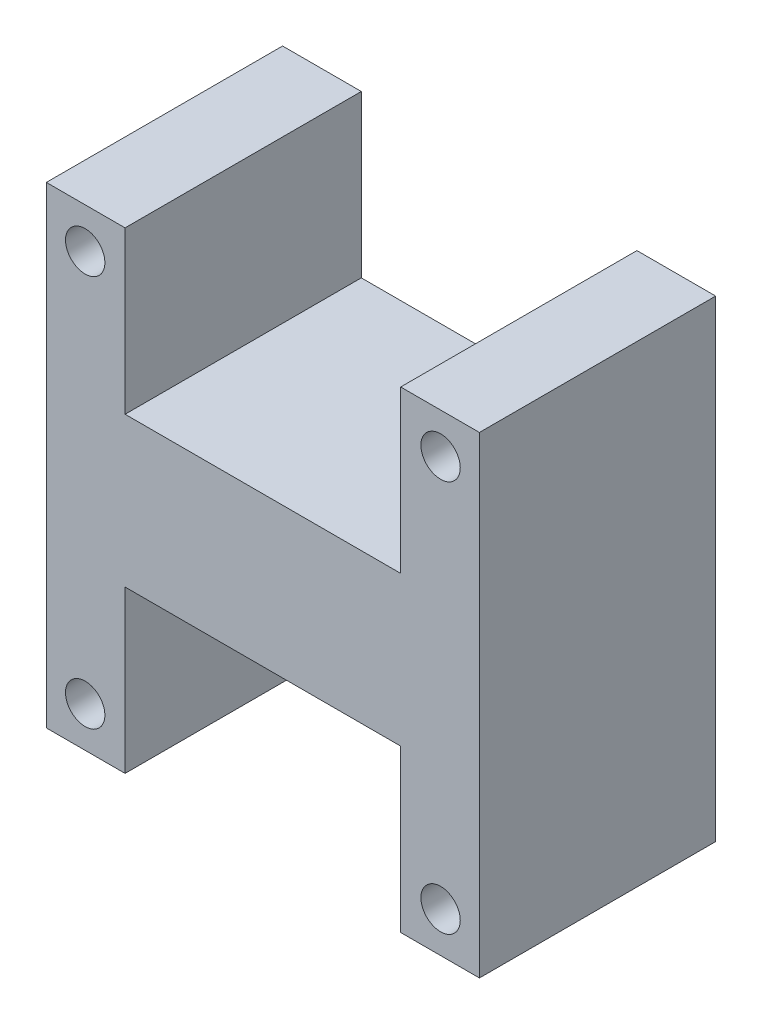
ISO-10303-21;
HEADER;
FILE_DESCRIPTION(('STEP AP214'),'2;1');
FILE_NAME('part.step','',(''),(''),'','','');
FILE_SCHEMA(('AUTOMOTIVE_DESIGN { 1 0 10303 214 1 1 1 1 }'));
ENDSEC;
DATA;
#1=APPLICATION_CONTEXT('core data for automotive mechanical design processes');
#2=APPLICATION_PROTOCOL_DEFINITION('international standard','automotive_design',2000,#1);
#3=PRODUCT_CONTEXT('',#1,'mechanical');
#4=PRODUCT('Part','Part','',(#3));
#5=PRODUCT_RELATED_PRODUCT_CATEGORY('part','',(#4));
#6=PRODUCT_DEFINITION_FORMATION('','',#4);
#7=PRODUCT_DEFINITION_CONTEXT('part definition',#1,'design');
#8=PRODUCT_DEFINITION('design','',#6,#7);
#9=PRODUCT_DEFINITION_SHAPE('','',#8);
#10=(LENGTH_UNIT() NAMED_UNIT(*) SI_UNIT(.MILLI.,.METRE.));
#11=(NAMED_UNIT(*) PLANE_ANGLE_UNIT() SI_UNIT($,.RADIAN.));
#12=(NAMED_UNIT(*) SI_UNIT($,.STERADIAN.) SOLID_ANGLE_UNIT());
#13=UNCERTAINTY_MEASURE_WITH_UNIT(LENGTH_MEASURE(1.E-05),#10,'distance_accuracy_value','');
#14=(GEOMETRIC_REPRESENTATION_CONTEXT(3) GLOBAL_UNCERTAINTY_ASSIGNED_CONTEXT((#13)) GLOBAL_UNIT_ASSIGNED_CONTEXT((#10,
#11,#12)) REPRESENTATION_CONTEXT('',''));
#15=CARTESIAN_POINT('',(0.,0.,0.));
#16=DIRECTION('',(0.,0.,1.));
#17=DIRECTION('',(1.,0.,0.));
#18=AXIS2_PLACEMENT_3D('',#15,#16,#17);
#19=CARTESIAN_POINT('',(57.15,0.,38.1));
#20=DIRECTION('',(-1.,0.,0.));
#21=DIRECTION('',(0.,0.,1.));
#22=AXIS2_PLACEMENT_3D('',#19,#20,#21);
#23=PLANE('',#22);
#24=DIRECTION('',(0.,1.,0.));
#25=VECTOR('',#24,1.);
#26=CARTESIAN_POINT('',(57.15,0.,0.));
#27=LINE('',#26,#25);
#28=CARTESIAN_POINT('',(57.15,0.,0.));
#29=VERTEX_POINT('',#28);
#30=CARTESIAN_POINT('',(57.15,26.035,0.));
#31=VERTEX_POINT('',#30);
#32=EDGE_CURVE('E194',#29,#31,#27,.T.);
#33=ORIENTED_EDGE('',*,*,#32,.F.);
#34=DIRECTION('',(0.,0.,-1.));
#35=VECTOR('',#34,1.);
#36=CARTESIAN_POINT('',(57.15,0.,38.1));
#37=LINE('',#36,#35);
#38=CARTESIAN_POINT('',(57.15,0.,38.1));
#39=VERTEX_POINT('',#38);
#40=EDGE_CURVE('E13',#39,#29,#37,.T.);
#41=ORIENTED_EDGE('',*,*,#40,.F.);
#42=DIRECTION('',(0.,1.,0.));
#43=VECTOR('',#42,1.);
#44=CARTESIAN_POINT('',(57.15,0.,38.1));
#45=LINE('',#44,#43);
#46=CARTESIAN_POINT('',(57.15,26.035,38.1));
#47=VERTEX_POINT('',#46);
#48=EDGE_CURVE('E301',#39,#47,#45,.T.);
#49=ORIENTED_EDGE('',*,*,#48,.T.);
#50=DIRECTION('',(0.,0.,-1.));
#51=VECTOR('',#50,1.);
#52=CARTESIAN_POINT('',(57.15,26.035,38.1));
#53=LINE('',#52,#51);
#54=EDGE_CURVE('E107',#47,#31,#53,.T.);
#55=ORIENTED_EDGE('',*,*,#54,.T.);
#56=EDGE_LOOP('',(#33,#41,#49,#55));
#57=FACE_BOUND('',#56,.T.);
#58=ADVANCED_FACE('F44',(#57),#23,.T.);
#59=CARTESIAN_POINT('',(0.,0.,38.1));
#60=DIRECTION('',(0.,1.,0.));
#61=DIRECTION('',(0.,0.,1.));
#62=AXIS2_PLACEMENT_3D('',#59,#60,#61);
#63=PLANE('',#62);
#64=DIRECTION('',(1.,0.,0.));
#65=VECTOR('',#64,1.);
#66=CARTESIAN_POINT('',(0.,0.,0.));
#67=LINE('',#66,#65);
#68=CARTESIAN_POINT('',(69.85,0.,0.));
#69=VERTEX_POINT('',#68);
#70=EDGE_CURVE('E192',#29,#69,#67,.T.);
#71=ORIENTED_EDGE('',*,*,#70,.T.);
#72=DIRECTION('',(0.,0.,-1.));
#73=VECTOR('',#72,1.);
#74=CARTESIAN_POINT('',(69.85,0.,38.1));
#75=LINE('',#74,#73);
#76=CARTESIAN_POINT('',(69.85,0.,38.1));
#77=VERTEX_POINT('',#76);
#78=EDGE_CURVE('E53',#77,#69,#75,.T.);
#79=ORIENTED_EDGE('',*,*,#78,.F.);
#80=DIRECTION('',(1.,0.,0.));
#81=VECTOR('',#80,1.);
#82=CARTESIAN_POINT('',(0.,0.,38.1));
#83=LINE('',#82,#81);
#84=EDGE_CURVE('E158',#39,#77,#83,.T.);
#85=ORIENTED_EDGE('',*,*,#84,.F.);
#86=ORIENTED_EDGE('',*,*,#40,.T.);
#87=EDGE_LOOP('',(#71,#79,#85,#86));
#88=FACE_BOUND('',#87,.T.);
#89=ADVANCED_FACE('F193',(#88),#63,.F.);
#90=CARTESIAN_POINT('',(69.85,0.,38.1));
#91=DIRECTION('',(-1.,0.,0.));
#92=DIRECTION('',(0.,0.,1.));
#93=AXIS2_PLACEMENT_3D('',#90,#91,#92);
#94=PLANE('',#93);
#95=DIRECTION('',(0.,1.,0.));
#96=VECTOR('',#95,1.);
#97=CARTESIAN_POINT('',(69.85,0.,0.));
#98=LINE('',#97,#96);
#99=CARTESIAN_POINT('',(69.85,76.2,0.));
#100=VERTEX_POINT('',#99);
#101=EDGE_CURVE('E186',#69,#100,#98,.T.);
#102=ORIENTED_EDGE('',*,*,#101,.T.);
#103=DIRECTION('',(0.,0.,-1.));
#104=VECTOR('',#103,1.);
#105=CARTESIAN_POINT('',(69.85,76.2,38.1));
#106=LINE('',#105,#104);
#107=CARTESIAN_POINT('',(69.85,76.2,38.1));
#108=VERTEX_POINT('',#107);
#109=EDGE_CURVE('E178',#108,#100,#106,.T.);
#110=ORIENTED_EDGE('',*,*,#109,.F.);
#111=DIRECTION('',(0.,1.,0.));
#112=VECTOR('',#111,1.);
#113=CARTESIAN_POINT('',(69.85,0.,38.1));
#114=LINE('',#113,#112);
#115=EDGE_CURVE('E188',#77,#108,#114,.T.);
#116=ORIENTED_EDGE('',*,*,#115,.F.);
#117=ORIENTED_EDGE('',*,*,#78,.T.);
#118=EDGE_LOOP('',(#102,#110,#116,#117));
#119=FACE_BOUND('',#118,.T.);
#120=ADVANCED_FACE('F184',(#119),#94,.F.);
#121=CARTESIAN_POINT('',(0.,76.2,38.1));
#122=DIRECTION('',(0.,1.,0.));
#123=DIRECTION('',(0.,0.,1.));
#124=AXIS2_PLACEMENT_3D('',#121,#122,#123);
#125=PLANE('',#124);
#126=DIRECTION('',(1.,0.,0.));
#127=VECTOR('',#126,1.);
#128=CARTESIAN_POINT('',(0.,76.2,0.));
#129=LINE('',#128,#127);
#130=CARTESIAN_POINT('',(57.15,76.2,0.));
#131=VERTEX_POINT('',#130);
#132=EDGE_CURVE('E196',#131,#100,#129,.T.);
#133=ORIENTED_EDGE('',*,*,#132,.F.);
#134=DIRECTION('',(0.,0.,-1.));
#135=VECTOR('',#134,1.);
#136=CARTESIAN_POINT('',(57.15,76.2,38.1));
#137=LINE('',#136,#135);
#138=CARTESIAN_POINT('',(57.15,76.2,38.1));
#139=VERTEX_POINT('',#138);
#140=EDGE_CURVE('E176',#139,#131,#137,.T.);
#141=ORIENTED_EDGE('',*,*,#140,.F.);
#142=DIRECTION('',(1.,0.,0.));
#143=VECTOR('',#142,1.);
#144=CARTESIAN_POINT('',(0.,76.2,38.1));
#145=LINE('',#144,#143);
#146=EDGE_CURVE('E308',#139,#108,#145,.T.);
#147=ORIENTED_EDGE('',*,*,#146,.T.);
#148=ORIENTED_EDGE('',*,*,#109,.T.);
#149=EDGE_LOOP('',(#133,#141,#147,#148));
#150=FACE_BOUND('',#149,.T.);
#151=ADVANCED_FACE('F257',(#150),#125,.T.);
#152=CARTESIAN_POINT('',(57.15,0.,38.1));
#153=DIRECTION('',(1.,0.,0.));
#154=DIRECTION('',(0.,0.,-1.));
#155=AXIS2_PLACEMENT_3D('',#152,#153,#154);
#156=PLANE('',#155);
#157=DIRECTION('',(0.,-1.,0.));
#158=VECTOR('',#157,1.);
#159=CARTESIAN_POINT('',(57.15,0.,0.));
#160=LINE('',#159,#158);
#161=CARTESIAN_POINT('',(57.15,50.165,0.));
#162=VERTEX_POINT('',#161);
#163=EDGE_CURVE('E332',#131,#162,#160,.T.);
#164=ORIENTED_EDGE('',*,*,#163,.T.);
#165=DIRECTION('',(0.,0.,-1.));
#166=VECTOR('',#165,1.);
#167=CARTESIAN_POINT('',(57.15,50.165,38.1));
#168=LINE('',#167,#166);
#169=CARTESIAN_POINT('',(57.15,50.165,38.1));
#170=VERTEX_POINT('',#169);
#171=EDGE_CURVE('E174',#170,#162,#168,.T.);
#172=ORIENTED_EDGE('',*,*,#171,.F.);
#173=DIRECTION('',(0.,-1.,0.));
#174=VECTOR('',#173,1.);
#175=CARTESIAN_POINT('',(57.15,0.,38.1));
#176=LINE('',#175,#174);
#177=EDGE_CURVE('E311',#139,#170,#176,.T.);
#178=ORIENTED_EDGE('',*,*,#177,.F.);
#179=ORIENTED_EDGE('',*,*,#140,.T.);
#180=EDGE_LOOP('',(#164,#172,#178,#179));
#181=FACE_BOUND('',#180,.T.);
#182=ADVANCED_FACE('F258',(#181),#156,.F.);
#183=CARTESIAN_POINT('',(0.,50.165,38.1));
#184=DIRECTION('',(0.,1.,0.));
#185=DIRECTION('',(0.,0.,1.));
#186=AXIS2_PLACEMENT_3D('',#183,#184,#185);
#187=PLANE('',#186);
#188=DIRECTION('',(1.,0.,0.));
#189=VECTOR('',#188,1.);
#190=CARTESIAN_POINT('',(0.,50.165,0.));
#191=LINE('',#190,#189);
#192=CARTESIAN_POINT('',(12.7,50.165,0.));
#193=VERTEX_POINT('',#192);
#194=EDGE_CURVE('E328',#193,#162,#191,.T.);
#195=ORIENTED_EDGE('',*,*,#194,.F.);
#196=DIRECTION('',(0.,0.,-1.));
#197=VECTOR('',#196,1.);
#198=CARTESIAN_POINT('',(12.7,50.165,38.1));
#199=LINE('',#198,#197);
#200=CARTESIAN_POINT('',(12.7,50.165,38.1));
#201=VERTEX_POINT('',#200);
#202=EDGE_CURVE('E172',#201,#193,#199,.T.);
#203=ORIENTED_EDGE('',*,*,#202,.F.);
#204=DIRECTION('',(1.,0.,0.));
#205=VECTOR('',#204,1.);
#206=CARTESIAN_POINT('',(0.,50.165,38.1));
#207=LINE('',#206,#205);
#208=EDGE_CURVE('E314',#201,#170,#207,.T.);
#209=ORIENTED_EDGE('',*,*,#208,.T.);
#210=ORIENTED_EDGE('',*,*,#171,.T.);
#211=EDGE_LOOP('',(#195,#203,#209,#210));
#212=FACE_BOUND('',#211,.T.);
#213=ADVANCED_FACE('F261',(#212),#187,.T.);
#214=CARTESIAN_POINT('',(12.7,0.,38.1));
#215=DIRECTION('',(1.,0.,0.));
#216=DIRECTION('',(0.,1.,0.));
#217=AXIS2_PLACEMENT_3D('',#214,#215,#216);
#218=PLANE('',#217);
#219=DIRECTION('',(0.,-1.,0.));
#220=VECTOR('',#219,1.);
#221=CARTESIAN_POINT('',(12.7,0.,0.));
#222=LINE('',#221,#220);
#223=CARTESIAN_POINT('',(12.7,76.2,0.));
#224=VERTEX_POINT('',#223);
#225=EDGE_CURVE('E208',#224,#193,#222,.T.);
#226=ORIENTED_EDGE('',*,*,#225,.F.);
#227=DIRECTION('',(0.,0.,-1.));
#228=VECTOR('',#227,1.);
#229=CARTESIAN_POINT('',(12.7,76.2,38.1));
#230=LINE('',#229,#228);
#231=CARTESIAN_POINT('',(12.7,76.2,38.1));
#232=VERTEX_POINT('',#231);
#233=EDGE_CURVE('E170',#232,#224,#230,.T.);
#234=ORIENTED_EDGE('',*,*,#233,.F.);
#235=DIRECTION('',(0.,-1.,0.));
#236=VECTOR('',#235,1.);
#237=CARTESIAN_POINT('',(12.7,0.,38.1));
#238=LINE('',#237,#236);
#239=EDGE_CURVE('E317',#232,#201,#238,.T.);
#240=ORIENTED_EDGE('',*,*,#239,.T.);
#241=ORIENTED_EDGE('',*,*,#202,.T.);
#242=EDGE_LOOP('',(#226,#234,#240,#241));
#243=FACE_BOUND('',#242,.T.);
#244=ADVANCED_FACE('F265',(#243),#218,.T.);
#245=CARTESIAN_POINT('',(0.,76.2,0.));
#246=VERTEX_POINT('',#245);
#247=EDGE_CURVE('E204',#246,#224,#129,.T.);
#248=ORIENTED_EDGE('',*,*,#247,.F.);
#249=DIRECTION('',(0.,0.,-1.));
#250=VECTOR('',#249,1.);
#251=CARTESIAN_POINT('',(0.,76.2,38.1));
#252=LINE('',#251,#250);
#253=CARTESIAN_POINT('',(0.,76.2,38.1));
#254=VERTEX_POINT('',#253);
#255=EDGE_CURVE('E164',#254,#246,#252,.T.);
#256=ORIENTED_EDGE('',*,*,#255,.F.);
#257=EDGE_CURVE('E312',#254,#232,#145,.T.);
#258=ORIENTED_EDGE('',*,*,#257,.T.);
#259=ORIENTED_EDGE('',*,*,#233,.T.);
#260=EDGE_LOOP('',(#248,#256,#258,#259));
#261=FACE_BOUND('',#260,.T.);
#262=ADVANCED_FACE('F269',(#261),#125,.T.);
#263=CARTESIAN_POINT('',(0.,0.,38.1));
#264=DIRECTION('',(-1.,0.,0.));
#265=DIRECTION('',(0.,0.,1.));
#266=AXIS2_PLACEMENT_3D('',#263,#264,#265);
#267=PLANE('',#266);
#268=DIRECTION('',(0.,1.,0.));
#269=VECTOR('',#268,1.);
#270=CARTESIAN_POINT('',(0.,0.,0.));
#271=LINE('',#270,#269);
#272=CARTESIAN_POINT('',(0.,0.,0.));
#273=VERTEX_POINT('',#272);
#274=EDGE_CURVE('E201',#273,#246,#271,.T.);
#275=ORIENTED_EDGE('',*,*,#274,.F.);
#276=DIRECTION('',(0.,0.,-1.));
#277=VECTOR('',#276,1.);
#278=CARTESIAN_POINT('',(0.,0.,38.1));
#279=LINE('',#278,#277);
#280=CARTESIAN_POINT('',(0.,0.,38.1));
#281=VERTEX_POINT('',#280);
#282=EDGE_CURVE('E162',#281,#273,#279,.T.);
#283=ORIENTED_EDGE('',*,*,#282,.F.);
#284=DIRECTION('',(0.,1.,0.));
#285=VECTOR('',#284,1.);
#286=CARTESIAN_POINT('',(0.,0.,38.1));
#287=LINE('',#286,#285);
#288=EDGE_CURVE('E155',#281,#254,#287,.T.);
#289=ORIENTED_EDGE('',*,*,#288,.T.);
#290=ORIENTED_EDGE('',*,*,#255,.T.);
#291=EDGE_LOOP('',(#275,#283,#289,#290));
#292=FACE_BOUND('',#291,.T.);
#293=ADVANCED_FACE('F273',(#292),#267,.T.);
#294=CARTESIAN_POINT('',(12.7,0.,0.));
#295=VERTEX_POINT('',#294);
#296=EDGE_CURVE('E161',#273,#295,#67,.T.);
#297=ORIENTED_EDGE('',*,*,#296,.T.);
#298=DIRECTION('',(0.,0.,-1.));
#299=VECTOR('',#298,1.);
#300=CARTESIAN_POINT('',(12.7,0.,38.1));
#301=LINE('',#300,#299);
#302=CARTESIAN_POINT('',(12.7,0.,38.1));
#303=VERTEX_POINT('',#302);
#304=EDGE_CURVE('E144',#303,#295,#301,.T.);
#305=ORIENTED_EDGE('',*,*,#304,.F.);
#306=EDGE_CURVE('E147',#281,#303,#83,.T.);
#307=ORIENTED_EDGE('',*,*,#306,.F.);
#308=ORIENTED_EDGE('',*,*,#282,.T.);
#309=EDGE_LOOP('',(#297,#305,#307,#308));
#310=FACE_BOUND('',#309,.T.);
#311=ADVANCED_FACE('F159',(#310),#63,.F.);
#312=CARTESIAN_POINT('',(12.7,0.,38.1));
#313=DIRECTION('',(-1.,0.,0.));
#314=DIRECTION('',(0.,-1.,0.));
#315=AXIS2_PLACEMENT_3D('',#312,#313,#314);
#316=PLANE('',#315);
#317=DIRECTION('',(0.,1.,0.));
#318=VECTOR('',#317,1.);
#319=CARTESIAN_POINT('',(12.7,0.,0.));
#320=LINE('',#319,#318);
#321=CARTESIAN_POINT('',(12.7,26.035,0.));
#322=VERTEX_POINT('',#321);
#323=EDGE_CURVE('E200',#295,#322,#320,.T.);
#324=ORIENTED_EDGE('',*,*,#323,.T.);
#325=DIRECTION('',(0.,0.,-1.));
#326=VECTOR('',#325,1.);
#327=CARTESIAN_POINT('',(12.7,26.035,38.1));
#328=LINE('',#327,#326);
#329=CARTESIAN_POINT('',(12.7,26.035,38.1));
#330=VERTEX_POINT('',#329);
#331=EDGE_CURVE('E146',#330,#322,#328,.T.);
#332=ORIENTED_EDGE('',*,*,#331,.F.);
#333=DIRECTION('',(0.,1.,0.));
#334=VECTOR('',#333,1.);
#335=CARTESIAN_POINT('',(12.7,0.,38.1));
#336=LINE('',#335,#334);
#337=EDGE_CURVE('E139',#303,#330,#336,.T.);
#338=ORIENTED_EDGE('',*,*,#337,.F.);
#339=ORIENTED_EDGE('',*,*,#304,.T.);
#340=EDGE_LOOP('',(#324,#332,#338,#339));
#341=FACE_BOUND('',#340,.T.);
#342=ADVANCED_FACE('F142',(#341),#316,.F.);
#343=CARTESIAN_POINT('',(0.,26.035,38.1));
#344=DIRECTION('',(0.,1.,0.));
#345=DIRECTION('',(0.,0.,1.));
#346=AXIS2_PLACEMENT_3D('',#343,#344,#345);
#347=PLANE('',#346);
#348=DIRECTION('',(1.,0.,0.));
#349=VECTOR('',#348,1.);
#350=CARTESIAN_POINT('',(0.,26.035,0.));
#351=LINE('',#350,#349);
#352=EDGE_CURVE('E100',#322,#31,#351,.T.);
#353=ORIENTED_EDGE('',*,*,#352,.T.);
#354=ORIENTED_EDGE('',*,*,#54,.F.);
#355=DIRECTION('',(1.,0.,0.));
#356=VECTOR('',#355,1.);
#357=CARTESIAN_POINT('',(0.,26.035,38.1));
#358=LINE('',#357,#356);
#359=EDGE_CURVE('E61',#330,#47,#358,.T.);
#360=ORIENTED_EDGE('',*,*,#359,.F.);
#361=ORIENTED_EDGE('',*,*,#331,.T.);
#362=EDGE_LOOP('',(#353,#354,#360,#361));
#363=FACE_BOUND('',#362,.T.);
#364=ADVANCED_FACE('F237',(#363),#347,.F.);
#365=CARTESIAN_POINT('',(6.2656146179402,6.49767441860466,38.1));
#366=DIRECTION('',(0.,0.,-1.));
#367=DIRECTION('',(-1.,0.,0.));
#368=AXIS2_PLACEMENT_3D('',#365,#366,#367);
#369=CYLINDRICAL_SURFACE('',#368,3.175);
#370=CARTESIAN_POINT('',(6.2656146179402,6.49767441860466,38.1));
#371=DIRECTION('',(0.,0.,1.));
#372=DIRECTION('',(1.,0.,0.));
#373=AXIS2_PLACEMENT_3D('',#370,#371,#372);
#374=CIRCLE('',#373,3.175);
#375=CARTESIAN_POINT('',(9.4406146179402,6.49767441860466,38.1));
#376=VERTEX_POINT('',#375);
#377=EDGE_CURVE('E300',#376,#376,#374,.T.);
#378=ORIENTED_EDGE('',*,*,#377,.T.);
#379=EDGE_LOOP('',(#378));
#380=FACE_BOUND('',#379,.T.);
#381=CARTESIAN_POINT('',(6.2656146179402,6.49767441860466,0.));
#382=DIRECTION('',(0.,0.,1.));
#383=DIRECTION('',(1.,0.,0.));
#384=AXIS2_PLACEMENT_3D('',#381,#382,#383);
#385=CIRCLE('',#384,3.175);
#386=CARTESIAN_POINT('',(9.4406146179402,6.49767441860466,0.));
#387=VERTEX_POINT('',#386);
#388=EDGE_CURVE('E198',#387,#387,#385,.T.);
#389=ORIENTED_EDGE('',*,*,#388,.F.);
#390=EDGE_LOOP('',(#389));
#391=FACE_BOUND('',#390,.T.);
#392=ADVANCED_FACE('F234',(#380,#391),#369,.F.);
#393=CARTESIAN_POINT('',(63.5843853820598,6.49767441860472,38.1));
#394=DIRECTION('',(0.,0.,-1.));
#395=DIRECTION('',(-1.,0.,0.));
#396=AXIS2_PLACEMENT_3D('',#393,#394,#395);
#397=CYLINDRICAL_SURFACE('',#396,3.175);
#398=CARTESIAN_POINT('',(63.5843853820598,6.49767441860472,38.1));
#399=DIRECTION('',(0.,0.,1.));
#400=DIRECTION('',(1.,0.,0.));
#401=AXIS2_PLACEMENT_3D('',#398,#399,#400);
#402=CIRCLE('',#401,3.175);
#403=CARTESIAN_POINT('',(66.7593853820598,6.49767441860472,38.1));
#404=VERTEX_POINT('',#403);
#405=EDGE_CURVE('E298',#404,#404,#402,.F.);
#406=ORIENTED_EDGE('',*,*,#405,.F.);
#407=EDGE_LOOP('',(#406));
#408=FACE_BOUND('',#407,.T.);
#409=CARTESIAN_POINT('',(63.5843853820598,6.49767441860472,0.));
#410=DIRECTION('',(0.,0.,1.));
#411=DIRECTION('',(1.,0.,0.));
#412=AXIS2_PLACEMENT_3D('',#409,#410,#411);
#413=CIRCLE('',#412,3.175);
#414=CARTESIAN_POINT('',(66.7593853820598,6.49767441860472,0.));
#415=VERTEX_POINT('',#414);
#416=EDGE_CURVE('E226',#415,#415,#413,.F.);
#417=ORIENTED_EDGE('',*,*,#416,.T.);
#418=EDGE_LOOP('',(#417));
#419=FACE_BOUND('',#418,.T.);
#420=ADVANCED_FACE('F236',(#408,#419),#397,.F.);
#421=CARTESIAN_POINT('',(63.5843853820598,69.7023255813953,38.1));
#422=DIRECTION('',(0.,0.,-1.));
#423=DIRECTION('',(-1.,0.,0.));
#424=AXIS2_PLACEMENT_3D('',#421,#422,#423);
#425=CYLINDRICAL_SURFACE('',#424,3.175);
#426=CARTESIAN_POINT('',(63.5843853820598,69.7023255813953,38.1));
#427=DIRECTION('',(0.,0.,1.));
#428=DIRECTION('',(1.,0.,0.));
#429=AXIS2_PLACEMENT_3D('',#426,#427,#428);
#430=CIRCLE('',#429,3.175);
#431=CARTESIAN_POINT('',(66.7593853820598,69.7023255813953,38.1));
#432=VERTEX_POINT('',#431);
#433=EDGE_CURVE('E216',#432,#432,#430,.T.);
#434=ORIENTED_EDGE('',*,*,#433,.T.);
#435=EDGE_LOOP('',(#434));
#436=FACE_BOUND('',#435,.T.);
#437=CARTESIAN_POINT('',(63.5843853820598,69.7023255813953,0.));
#438=DIRECTION('',(0.,0.,1.));
#439=DIRECTION('',(1.,0.,0.));
#440=AXIS2_PLACEMENT_3D('',#437,#438,#439);
#441=CIRCLE('',#440,3.175);
#442=CARTESIAN_POINT('',(66.7593853820598,69.7023255813953,0.));
#443=VERTEX_POINT('',#442);
#444=EDGE_CURVE('E223',#443,#443,#441,.T.);
#445=ORIENTED_EDGE('',*,*,#444,.F.);
#446=EDGE_LOOP('',(#445));
#447=FACE_BOUND('',#446,.T.);
#448=ADVANCED_FACE('F46',(#436,#447),#425,.F.);
#449=CARTESIAN_POINT('',(6.2656146179402,69.7023255813953,38.1));
#450=DIRECTION('',(0.,0.,-1.));
#451=DIRECTION('',(-1.,0.,0.));
#452=AXIS2_PLACEMENT_3D('',#449,#450,#451);
#453=CYLINDRICAL_SURFACE('',#452,3.175);
#454=CARTESIAN_POINT('',(6.2656146179402,69.7023255813953,38.1));
#455=DIRECTION('',(0.,0.,1.));
#456=DIRECTION('',(1.,0.,0.));
#457=AXIS2_PLACEMENT_3D('',#454,#455,#456);
#458=CIRCLE('',#457,3.175);
#459=CARTESIAN_POINT('',(9.4406146179402,69.7023255813953,38.1));
#460=VERTEX_POINT('',#459);
#461=EDGE_CURVE('E217',#460,#460,#458,.F.);
#462=ORIENTED_EDGE('',*,*,#461,.F.);
#463=EDGE_LOOP('',(#462));
#464=FACE_BOUND('',#463,.T.);
#465=CARTESIAN_POINT('',(6.2656146179402,69.7023255813953,0.));
#466=DIRECTION('',(0.,0.,1.));
#467=DIRECTION('',(1.,0.,0.));
#468=AXIS2_PLACEMENT_3D('',#465,#466,#467);
#469=CIRCLE('',#468,3.175);
#470=CARTESIAN_POINT('',(9.4406146179402,69.7023255813953,0.));
#471=VERTEX_POINT('',#470);
#472=EDGE_CURVE('E214',#471,#471,#469,.F.);
#473=ORIENTED_EDGE('',*,*,#472,.T.);
#474=EDGE_LOOP('',(#473));
#475=FACE_BOUND('',#474,.T.);
#476=ADVANCED_FACE('F281',(#464,#475),#453,.F.);
#477=CARTESIAN_POINT('',(0.,0.,38.1));
#478=DIRECTION('',(0.,0.,1.));
#479=DIRECTION('',(1.,0.,0.));
#480=AXIS2_PLACEMENT_3D('',#477,#478,#479);
#481=PLANE('',#480);
#482=ORIENTED_EDGE('',*,*,#433,.F.);
#483=EDGE_LOOP('',(#482));
#484=FACE_BOUND('',#483,.T.);
#485=ORIENTED_EDGE('',*,*,#405,.T.);
#486=EDGE_LOOP('',(#485));
#487=FACE_BOUND('',#486,.T.);
#488=ORIENTED_EDGE('',*,*,#377,.F.);
#489=EDGE_LOOP('',(#488));
#490=FACE_BOUND('',#489,.T.);
#491=ORIENTED_EDGE('',*,*,#48,.F.);
#492=ORIENTED_EDGE('',*,*,#84,.T.);
#493=ORIENTED_EDGE('',*,*,#115,.T.);
#494=ORIENTED_EDGE('',*,*,#146,.F.);
#495=ORIENTED_EDGE('',*,*,#177,.T.);
#496=ORIENTED_EDGE('',*,*,#208,.F.);
#497=ORIENTED_EDGE('',*,*,#239,.F.);
#498=ORIENTED_EDGE('',*,*,#257,.F.);
#499=ORIENTED_EDGE('',*,*,#288,.F.);
#500=ORIENTED_EDGE('',*,*,#306,.T.);
#501=ORIENTED_EDGE('',*,*,#337,.T.);
#502=ORIENTED_EDGE('',*,*,#359,.T.);
#503=EDGE_LOOP('',(#491,#492,#493,#494,#495,#496,#497,#498,#499,#500,#501,#502));
#504=FACE_BOUND('',#503,.T.);
#505=ORIENTED_EDGE('',*,*,#461,.T.);
#506=EDGE_LOOP('',(#505));
#507=FACE_BOUND('',#506,.T.);
#508=ADVANCED_FACE('F151',(#484,#487,#490,#504,#507),#481,.T.);
#509=CARTESIAN_POINT('',(0.,0.,0.));
#510=DIRECTION('',(0.,0.,1.));
#511=DIRECTION('',(1.,0.,0.));
#512=AXIS2_PLACEMENT_3D('',#509,#510,#511);
#513=PLANE('',#512);
#514=ORIENTED_EDGE('',*,*,#444,.T.);
#515=EDGE_LOOP('',(#514));
#516=FACE_BOUND('',#515,.T.);
#517=ORIENTED_EDGE('',*,*,#416,.F.);
#518=EDGE_LOOP('',(#517));
#519=FACE_BOUND('',#518,.T.);
#520=ORIENTED_EDGE('',*,*,#388,.T.);
#521=EDGE_LOOP('',(#520));
#522=FACE_BOUND('',#521,.T.);
#523=ORIENTED_EDGE('',*,*,#32,.T.);
#524=ORIENTED_EDGE('',*,*,#352,.F.);
#525=ORIENTED_EDGE('',*,*,#323,.F.);
#526=ORIENTED_EDGE('',*,*,#296,.F.);
#527=ORIENTED_EDGE('',*,*,#274,.T.);
#528=ORIENTED_EDGE('',*,*,#247,.T.);
#529=ORIENTED_EDGE('',*,*,#225,.T.);
#530=ORIENTED_EDGE('',*,*,#194,.T.);
#531=ORIENTED_EDGE('',*,*,#163,.F.);
#532=ORIENTED_EDGE('',*,*,#132,.T.);
#533=ORIENTED_EDGE('',*,*,#101,.F.);
#534=ORIENTED_EDGE('',*,*,#70,.F.);
#535=EDGE_LOOP('',(#523,#524,#525,#526,#527,#528,#529,#530,#531,#532,#533,#534));
#536=FACE_BOUND('',#535,.T.);
#537=ORIENTED_EDGE('',*,*,#472,.F.);
#538=EDGE_LOOP('',(#537));
#539=FACE_BOUND('',#538,.T.);
#540=ADVANCED_FACE('F232',(#516,#519,#522,#536,#539),#513,.F.);
#541=CLOSED_SHELL('',(#58,#89,#120,#151,#182,#213,#244,#262,#293,#311,#342,#364,#392,#420,#448,
#476,#508,#540));
#542=MANIFOLD_SOLID_BREP('B2',#541);
#543=ADVANCED_BREP_SHAPE_REPRESENTATION('',(#18,#542),#14);
#544=SHAPE_DEFINITION_REPRESENTATION(#9,#543);
ENDSEC;
END-ISO-10303-21;
